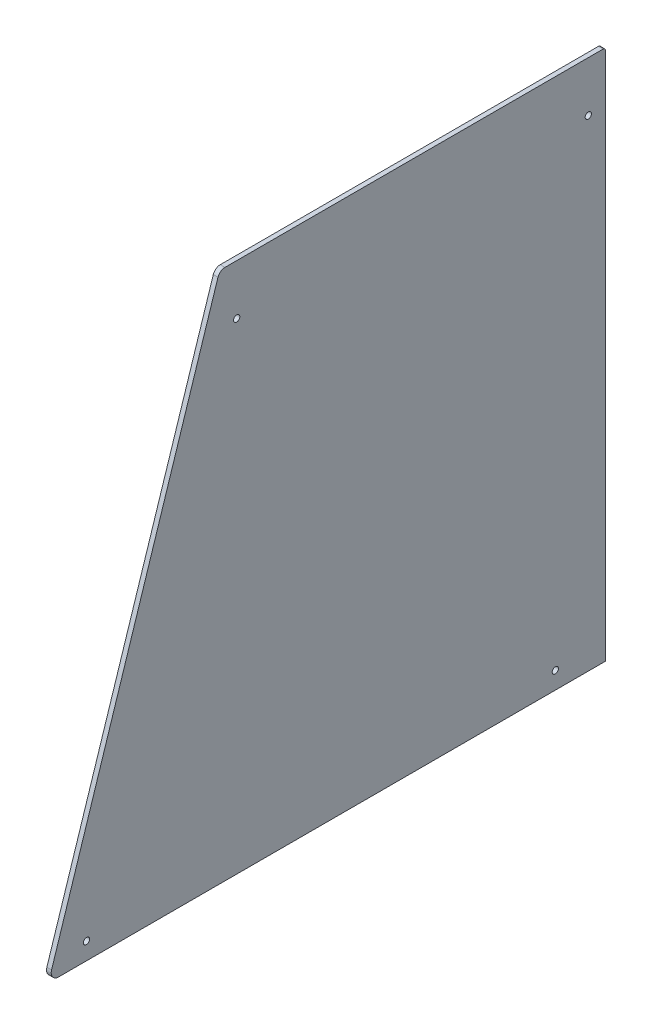
ISO-10303-21;
HEADER;
FILE_DESCRIPTION(('STEP AP214'),'2;1');
FILE_NAME('part.step','',(''),(''),'','','');
FILE_SCHEMA(('AUTOMOTIVE_DESIGN { 1 0 10303 214 1 1 1 1 }'));
ENDSEC;
DATA;
#1=APPLICATION_CONTEXT('core data for automotive mechanical design processes');
#2=APPLICATION_PROTOCOL_DEFINITION('international standard','automotive_design',2000,#1);
#3=PRODUCT_CONTEXT('',#1,'mechanical');
#4=PRODUCT('Part','Part','',(#3));
#5=PRODUCT_RELATED_PRODUCT_CATEGORY('part','',(#4));
#6=PRODUCT_DEFINITION_FORMATION('','',#4);
#7=PRODUCT_DEFINITION_CONTEXT('part definition',#1,'design');
#8=PRODUCT_DEFINITION('design','',#6,#7);
#9=PRODUCT_DEFINITION_SHAPE('','',#8);
#10=(LENGTH_UNIT() NAMED_UNIT(*) SI_UNIT(.MILLI.,.METRE.));
#11=(NAMED_UNIT(*) PLANE_ANGLE_UNIT() SI_UNIT($,.RADIAN.));
#12=(NAMED_UNIT(*) SI_UNIT($,.STERADIAN.) SOLID_ANGLE_UNIT());
#13=UNCERTAINTY_MEASURE_WITH_UNIT(LENGTH_MEASURE(1.E-05),#10,'distance_accuracy_value','');
#14=(GEOMETRIC_REPRESENTATION_CONTEXT(3) GLOBAL_UNCERTAINTY_ASSIGNED_CONTEXT((#13)) GLOBAL_UNIT_ASSIGNED_CONTEXT((#10,
#11,#12)) REPRESENTATION_CONTEXT('',''));
#15=CARTESIAN_POINT('',(0.,0.,0.));
#16=DIRECTION('',(0.,0.,1.));
#17=DIRECTION('',(1.,0.,0.));
#18=AXIS2_PLACEMENT_3D('',#15,#16,#17);
#19=CARTESIAN_POINT('',(107.5,328.5,-121.));
#20=DIRECTION('',(1.,0.,0.));
#21=DIRECTION('',(0.,0.,-1.));
#22=AXIS2_PLACEMENT_3D('',#19,#20,#21);
#23=CYLINDRICAL_SURFACE('',#22,1.50000000000002);
#24=CARTESIAN_POINT('',(110.5,328.5,-121.));
#25=DIRECTION('',(1.,0.,0.));
#26=DIRECTION('',(0.,0.,1.));
#27=AXIS2_PLACEMENT_3D('',#24,#25,#26);
#28=CIRCLE('',#27,1.50000000000002);
#29=CARTESIAN_POINT('',(110.5,328.5,-122.5));
#30=VERTEX_POINT('',#29);
#31=CARTESIAN_POINT('',(110.5,330.,-121.));
#32=VERTEX_POINT('',#31);
#33=EDGE_CURVE('E145',#30,#32,#28,.T.);
#34=ORIENTED_EDGE('',*,*,#33,.F.);
#35=DIRECTION('',(1.,0.,0.));
#36=VECTOR('',#35,1.);
#37=CARTESIAN_POINT('',(107.5,328.5,-122.5));
#38=LINE('',#37,#36);
#39=CARTESIAN_POINT('',(107.5,328.5,-122.5));
#40=VERTEX_POINT('',#39);
#41=EDGE_CURVE('E12',#40,#30,#38,.T.);
#42=ORIENTED_EDGE('',*,*,#41,.F.);
#43=CARTESIAN_POINT('',(107.5,328.5,-121.));
#44=DIRECTION('',(1.,0.,0.));
#45=DIRECTION('',(0.,0.,1.));
#46=AXIS2_PLACEMENT_3D('',#43,#44,#45);
#47=CIRCLE('',#46,1.50000000000002);
#48=CARTESIAN_POINT('',(107.5,330.,-121.));
#49=VERTEX_POINT('',#48);
#50=EDGE_CURVE('E178',#40,#49,#47,.T.);
#51=ORIENTED_EDGE('',*,*,#50,.T.);
#52=DIRECTION('',(1.,0.,0.));
#53=VECTOR('',#52,1.);
#54=CARTESIAN_POINT('',(107.5,330.,-121.));
#55=LINE('',#54,#53);
#56=EDGE_CURVE('E48',#49,#32,#55,.T.);
#57=ORIENTED_EDGE('',*,*,#56,.T.);
#58=EDGE_LOOP('',(#34,#42,#51,#57));
#59=FACE_BOUND('',#58,.T.);
#60=ADVANCED_FACE('F45',(#59),#23,.T.);
#61=CARTESIAN_POINT('',(107.5,328.5,-122.5));
#62=DIRECTION('',(0.,0.,-1.));
#63=DIRECTION('',(0.,1.,0.));
#64=AXIS2_PLACEMENT_3D('',#61,#62,#63);
#65=PLANE('',#64);
#66=DIRECTION('',(0.,1.,0.));
#67=VECTOR('',#66,1.);
#68=CARTESIAN_POINT('',(110.5,328.5,-122.5));
#69=LINE('',#68,#67);
#70=CARTESIAN_POINT('',(110.5,-10.,-122.5));
#71=VERTEX_POINT('',#70);
#72=EDGE_CURVE('E175',#71,#30,#69,.T.);
#73=ORIENTED_EDGE('',*,*,#72,.F.);
#74=DIRECTION('',(1.,0.,0.));
#75=VECTOR('',#74,1.);
#76=CARTESIAN_POINT('',(107.5,-10.,-122.5));
#77=LINE('',#76,#75);
#78=CARTESIAN_POINT('',(107.5,-10.,-122.5));
#79=VERTEX_POINT('',#78);
#80=EDGE_CURVE('E54',#79,#71,#77,.T.);
#81=ORIENTED_EDGE('',*,*,#80,.F.);
#82=DIRECTION('',(0.,1.,0.));
#83=VECTOR('',#82,1.);
#84=CARTESIAN_POINT('',(107.5,328.5,-122.5));
#85=LINE('',#84,#83);
#86=EDGE_CURVE('E131',#79,#40,#85,.T.);
#87=ORIENTED_EDGE('',*,*,#86,.T.);
#88=ORIENTED_EDGE('',*,*,#41,.T.);
#89=EDGE_LOOP('',(#73,#81,#87,#88));
#90=FACE_BOUND('',#89,.T.);
#91=ADVANCED_FACE('F190',(#90),#65,.T.);
#92=CARTESIAN_POINT('',(107.5,-10.,-122.5));
#93=DIRECTION('',(0.,-1.,0.));
#94=DIRECTION('',(0.,0.,-1.));
#95=AXIS2_PLACEMENT_3D('',#92,#93,#94);
#96=PLANE('',#95);
#97=DIRECTION('',(0.,0.,-1.));
#98=VECTOR('',#97,1.);
#99=CARTESIAN_POINT('',(110.5,-10.,-122.5));
#100=LINE('',#99,#98);
#101=CARTESIAN_POINT('',(110.5,-9.99999999999999,227.5));
#102=VERTEX_POINT('',#101);
#103=EDGE_CURVE('E117',#102,#71,#100,.T.);
#104=ORIENTED_EDGE('',*,*,#103,.F.);
#105=DIRECTION('',(1.,0.,0.));
#106=VECTOR('',#105,1.);
#107=CARTESIAN_POINT('',(107.5,-9.99999999999999,227.5));
#108=LINE('',#107,#106);
#109=CARTESIAN_POINT('',(107.5,-9.99999999999999,227.5));
#110=VERTEX_POINT('',#109);
#111=EDGE_CURVE('E112',#110,#102,#108,.T.);
#112=ORIENTED_EDGE('',*,*,#111,.F.);
#113=DIRECTION('',(0.,0.,-1.));
#114=VECTOR('',#113,1.);
#115=CARTESIAN_POINT('',(107.5,-10.,-122.5));
#116=LINE('',#115,#114);
#117=EDGE_CURVE('E115',#110,#79,#116,.T.);
#118=ORIENTED_EDGE('',*,*,#117,.T.);
#119=ORIENTED_EDGE('',*,*,#80,.T.);
#120=EDGE_LOOP('',(#104,#112,#118,#119));
#121=FACE_BOUND('',#120,.T.);
#122=ADVANCED_FACE('F114',(#121),#96,.T.);
#123=CARTESIAN_POINT('',(107.5,-5.30679634622494,227.5));
#124=DIRECTION('',(1.,0.,0.));
#125=DIRECTION('',(0.,0.,-1.));
#126=AXIS2_PLACEMENT_3D('',#123,#124,#125);
#127=CYLINDRICAL_SURFACE('',#126,4.69320365377507);
#128=CARTESIAN_POINT('',(110.5,-5.30679634622494,227.5));
#129=DIRECTION('',(1.,0.,0.));
#130=DIRECTION('',(0.,0.,1.));
#131=AXIS2_PLACEMENT_3D('',#128,#129,#130);
#132=CIRCLE('',#131,4.69320365377507);
#133=CARTESIAN_POINT('',(110.5,-3.86781721319163,231.967157887349));
#134=VERTEX_POINT('',#133);
#135=EDGE_CURVE('E169',#134,#102,#132,.T.);
#136=ORIENTED_EDGE('',*,*,#135,.F.);
#137=DIRECTION('',(1.,0.,0.));
#138=VECTOR('',#137,1.);
#139=CARTESIAN_POINT('',(107.5,-3.86781721319163,231.967157887349));
#140=LINE('',#139,#138);
#141=CARTESIAN_POINT('',(107.5,-3.86781721319163,231.967157887349));
#142=VERTEX_POINT('',#141);
#143=EDGE_CURVE('E123',#142,#134,#140,.T.);
#144=ORIENTED_EDGE('',*,*,#143,.F.);
#145=CARTESIAN_POINT('',(107.5,-5.30679634622494,227.5));
#146=DIRECTION('',(1.,0.,0.));
#147=DIRECTION('',(0.,0.,1.));
#148=AXIS2_PLACEMENT_3D('',#145,#146,#147);
#149=CIRCLE('',#148,4.69320365377507);
#150=EDGE_CURVE('E129',#142,#110,#149,.T.);
#151=ORIENTED_EDGE('',*,*,#150,.T.);
#152=ORIENTED_EDGE('',*,*,#111,.T.);
#153=EDGE_LOOP('',(#136,#144,#151,#152));
#154=FACE_BOUND('',#153,.T.);
#155=ADVANCED_FACE('F134',(#154),#127,.T.);
#156=CARTESIAN_POINT('',(107.5,-3.86781721319163,231.967157887349));
#157=DIRECTION('',(0.,0.30660913934042,0.951835508726653));
#158=DIRECTION('',(0.,-0.951835508726653,0.30660913934042));
#159=AXIS2_PLACEMENT_3D('',#156,#157,#158);
#160=PLANE('',#159);
#161=DIRECTION('',(0.,-0.951835508726653,0.30660913934042));
#162=VECTOR('',#161,1.);
#163=CARTESIAN_POINT('',(110.5,-3.86781721319163,231.967157887349));
#164=LINE('',#163,#162);
#165=CARTESIAN_POINT('',(110.5,326.745775479258,125.468557887349));
#166=VERTEX_POINT('',#165);
#167=EDGE_CURVE('E165',#166,#134,#164,.T.);
#168=ORIENTED_EDGE('',*,*,#167,.F.);
#169=DIRECTION('',(1.,0.,0.));
#170=VECTOR('',#169,1.);
#171=CARTESIAN_POINT('',(107.5,326.745775479258,125.468557887349));
#172=LINE('',#171,#170);
#173=CARTESIAN_POINT('',(107.5,326.745775479258,125.468557887349));
#174=VERTEX_POINT('',#173);
#175=EDGE_CURVE('E183',#174,#166,#172,.T.);
#176=ORIENTED_EDGE('',*,*,#175,.F.);
#177=DIRECTION('',(0.,-0.951835508726653,0.30660913934042));
#178=VECTOR('',#177,1.);
#179=CARTESIAN_POINT('',(107.5,-3.86781721319163,231.967157887349));
#180=LINE('',#179,#178);
#181=EDGE_CURVE('E136',#174,#142,#180,.T.);
#182=ORIENTED_EDGE('',*,*,#181,.T.);
#183=ORIENTED_EDGE('',*,*,#143,.T.);
#184=EDGE_LOOP('',(#168,#176,#182,#183));
#185=FACE_BOUND('',#184,.T.);
#186=ADVANCED_FACE('F203',(#185),#160,.T.);
#187=CARTESIAN_POINT('',(107.5,325.306796346225,121.0014));
#188=DIRECTION('',(1.,0.,0.));
#189=DIRECTION('',(0.,0.,-1.));
#190=AXIS2_PLACEMENT_3D('',#187,#188,#189);
#191=CYLINDRICAL_SURFACE('',#190,4.69320365377511);
#192=CARTESIAN_POINT('',(110.5,325.306796346225,121.0014));
#193=DIRECTION('',(1.,0.,0.));
#194=DIRECTION('',(0.,0.,1.));
#195=AXIS2_PLACEMENT_3D('',#192,#193,#194);
#196=CIRCLE('',#195,4.69320365377511);
#197=CARTESIAN_POINT('',(110.5,330.,121.0014));
#198=VERTEX_POINT('',#197);
#199=EDGE_CURVE('E162',#198,#166,#196,.T.);
#200=ORIENTED_EDGE('',*,*,#199,.F.);
#201=DIRECTION('',(1.,0.,0.));
#202=VECTOR('',#201,1.);
#203=CARTESIAN_POINT('',(107.5,330.,121.0014));
#204=LINE('',#203,#202);
#205=CARTESIAN_POINT('',(107.5,330.,121.0014));
#206=VERTEX_POINT('',#205);
#207=EDGE_CURVE('E184',#206,#198,#204,.T.);
#208=ORIENTED_EDGE('',*,*,#207,.F.);
#209=CARTESIAN_POINT('',(107.5,325.306796346225,121.0014));
#210=DIRECTION('',(1.,0.,0.));
#211=DIRECTION('',(0.,0.,1.));
#212=AXIS2_PLACEMENT_3D('',#209,#210,#211);
#213=CIRCLE('',#212,4.69320365377511);
#214=EDGE_CURVE('E140',#206,#174,#213,.T.);
#215=ORIENTED_EDGE('',*,*,#214,.T.);
#216=ORIENTED_EDGE('',*,*,#175,.T.);
#217=EDGE_LOOP('',(#200,#208,#215,#216));
#218=FACE_BOUND('',#217,.T.);
#219=ADVANCED_FACE('F206',(#218),#191,.T.);
#220=CARTESIAN_POINT('',(107.5,330.,121.0014));
#221=DIRECTION('',(0.,1.,0.));
#222=DIRECTION('',(0.,0.,1.));
#223=AXIS2_PLACEMENT_3D('',#220,#221,#222);
#224=PLANE('',#223);
#225=DIRECTION('',(0.,0.,1.));
#226=VECTOR('',#225,1.);
#227=CARTESIAN_POINT('',(110.5,330.,121.0014));
#228=LINE('',#227,#226);
#229=EDGE_CURVE('E149',#32,#198,#228,.T.);
#230=ORIENTED_EDGE('',*,*,#229,.F.);
#231=ORIENTED_EDGE('',*,*,#56,.F.);
#232=DIRECTION('',(0.,0.,1.));
#233=VECTOR('',#232,1.);
#234=CARTESIAN_POINT('',(107.5,330.,121.0014));
#235=LINE('',#234,#233);
#236=EDGE_CURVE('E273',#49,#206,#235,.T.);
#237=ORIENTED_EDGE('',*,*,#236,.T.);
#238=ORIENTED_EDGE('',*,*,#207,.T.);
#239=EDGE_LOOP('',(#230,#231,#237,#238));
#240=FACE_BOUND('',#239,.T.);
#241=ADVANCED_FACE('F187',(#240),#224,.T.);
#242=CARTESIAN_POINT('',(107.5,328.5,-121.));
#243=DIRECTION('',(-1.,0.,0.));
#244=DIRECTION('',(0.,0.,1.));
#245=AXIS2_PLACEMENT_3D('',#242,#243,#244);
#246=PLANE('',#245);
#247=CARTESIAN_POINT('',(107.5,297.910969137246,-111.5014));
#248=DIRECTION('',(-1.,0.,0.));
#249=DIRECTION('',(0.,0.,1.));
#250=AXIS2_PLACEMENT_3D('',#247,#248,#249);
#251=CIRCLE('',#250,2.);
#252=CARTESIAN_POINT('',(107.5,297.910969137246,-109.5014));
#253=VERTEX_POINT('',#252);
#254=EDGE_CURVE('E241',#253,#253,#251,.F.);
#255=ORIENTED_EDGE('',*,*,#254,.T.);
#256=EDGE_LOOP('',(#255));
#257=FACE_BOUND('',#256,.T.);
#258=CARTESIAN_POINT('',(107.5,0.998599999998107,-90.4109691372463));
#259=DIRECTION('',(-1.,0.,0.));
#260=DIRECTION('',(0.,0.,1.));
#261=AXIS2_PLACEMENT_3D('',#258,#259,#260);
#262=CIRCLE('',#261,2.);
#263=CARTESIAN_POINT('',(107.5,0.998599999998107,-88.4109691372463));
#264=VERTEX_POINT('',#263);
#265=EDGE_CURVE('E255',#264,#264,#262,.F.);
#266=ORIENTED_EDGE('',*,*,#265,.T.);
#267=EDGE_LOOP('',(#266));
#268=FACE_BOUND('',#267,.T.);
#269=CARTESIAN_POINT('',(107.5,0.998599999998107,209.589030862754));
#270=DIRECTION('',(-1.,0.,0.));
#271=DIRECTION('',(0.,0.,1.));
#272=AXIS2_PLACEMENT_3D('',#269,#270,#271);
#273=CIRCLE('',#272,2.);
#274=CARTESIAN_POINT('',(107.5,0.998599999998107,211.589030862754));
#275=VERTEX_POINT('',#274);
#276=EDGE_CURVE('E262',#275,#275,#273,.F.);
#277=ORIENTED_EDGE('',*,*,#276,.T.);
#278=EDGE_LOOP('',(#277));
#279=FACE_BOUND('',#278,.T.);
#280=CARTESIAN_POINT('',(107.5,297.910969137246,113.4986));
#281=DIRECTION('',(-1.,0.,0.));
#282=DIRECTION('',(0.,0.,1.));
#283=AXIS2_PLACEMENT_3D('',#280,#281,#282);
#284=CIRCLE('',#283,2.);
#285=CARTESIAN_POINT('',(107.5,297.910969137246,115.4986));
#286=VERTEX_POINT('',#285);
#287=EDGE_CURVE('E269',#286,#286,#284,.F.);
#288=ORIENTED_EDGE('',*,*,#287,.T.);
#289=EDGE_LOOP('',(#288));
#290=FACE_BOUND('',#289,.T.);
#291=ORIENTED_EDGE('',*,*,#50,.F.);
#292=ORIENTED_EDGE('',*,*,#86,.F.);
#293=ORIENTED_EDGE('',*,*,#117,.F.);
#294=ORIENTED_EDGE('',*,*,#150,.F.);
#295=ORIENTED_EDGE('',*,*,#181,.F.);
#296=ORIENTED_EDGE('',*,*,#214,.F.);
#297=ORIENTED_EDGE('',*,*,#236,.F.);
#298=EDGE_LOOP('',(#291,#292,#293,#294,#295,#296,#297));
#299=FACE_BOUND('',#298,.T.);
#300=ADVANCED_FACE('F127',(#257,#268,#279,#290,#299),#246,.T.);
#301=CARTESIAN_POINT('',(110.5,328.5,-121.));
#302=DIRECTION('',(-1.,0.,0.));
#303=DIRECTION('',(0.,0.,1.));
#304=AXIS2_PLACEMENT_3D('',#301,#302,#303);
#305=PLANE('',#304);
#306=CARTESIAN_POINT('',(110.5,297.910969137246,-111.5014));
#307=DIRECTION('',(1.,0.,0.));
#308=DIRECTION('',(0.,0.,-1.));
#309=AXIS2_PLACEMENT_3D('',#306,#307,#308);
#310=CIRCLE('',#309,2.);
#311=CARTESIAN_POINT('',(110.5,297.910969137246,-113.5014));
#312=VERTEX_POINT('',#311);
#313=EDGE_CURVE('E150',#312,#312,#310,.T.);
#314=ORIENTED_EDGE('',*,*,#313,.F.);
#315=EDGE_LOOP('',(#314));
#316=FACE_BOUND('',#315,.T.);
#317=CARTESIAN_POINT('',(110.5,0.998599999998107,-90.4109691372463));
#318=DIRECTION('',(1.,0.,0.));
#319=DIRECTION('',(0.,0.,-1.));
#320=AXIS2_PLACEMENT_3D('',#317,#318,#319);
#321=CIRCLE('',#320,2.);
#322=CARTESIAN_POINT('',(110.5,0.998599999998107,-92.4109691372463));
#323=VERTEX_POINT('',#322);
#324=EDGE_CURVE('E245',#323,#323,#321,.T.);
#325=ORIENTED_EDGE('',*,*,#324,.F.);
#326=EDGE_LOOP('',(#325));
#327=FACE_BOUND('',#326,.T.);
#328=CARTESIAN_POINT('',(110.5,0.998599999998107,209.589030862754));
#329=DIRECTION('',(1.,0.,0.));
#330=DIRECTION('',(0.,0.,-1.));
#331=AXIS2_PLACEMENT_3D('',#328,#329,#330);
#332=CIRCLE('',#331,2.);
#333=CARTESIAN_POINT('',(110.5,0.998599999998107,207.589030862754));
#334=VERTEX_POINT('',#333);
#335=EDGE_CURVE('E257',#334,#334,#332,.T.);
#336=ORIENTED_EDGE('',*,*,#335,.F.);
#337=EDGE_LOOP('',(#336));
#338=FACE_BOUND('',#337,.T.);
#339=CARTESIAN_POINT('',(110.5,297.910969137246,113.4986));
#340=DIRECTION('',(1.,0.,0.));
#341=DIRECTION('',(0.,0.,-1.));
#342=AXIS2_PLACEMENT_3D('',#339,#340,#341);
#343=CIRCLE('',#342,2.);
#344=CARTESIAN_POINT('',(110.5,297.910969137246,111.4986));
#345=VERTEX_POINT('',#344);
#346=EDGE_CURVE('E265',#345,#345,#343,.T.);
#347=ORIENTED_EDGE('',*,*,#346,.F.);
#348=EDGE_LOOP('',(#347));
#349=FACE_BOUND('',#348,.T.);
#350=ORIENTED_EDGE('',*,*,#33,.T.);
#351=ORIENTED_EDGE('',*,*,#229,.T.);
#352=ORIENTED_EDGE('',*,*,#199,.T.);
#353=ORIENTED_EDGE('',*,*,#167,.T.);
#354=ORIENTED_EDGE('',*,*,#135,.T.);
#355=ORIENTED_EDGE('',*,*,#103,.T.);
#356=ORIENTED_EDGE('',*,*,#72,.T.);
#357=EDGE_LOOP('',(#350,#351,#352,#353,#354,#355,#356));
#358=FACE_BOUND('',#357,.T.);
#359=ADVANCED_FACE('F189',(#316,#327,#338,#349,#358),#305,.F.);
#360=CARTESIAN_POINT('',(107.499,297.910969137246,113.4986));
#361=DIRECTION('',(1.,0.,0.));
#362=DIRECTION('',(0.,0.,-1.));
#363=AXIS2_PLACEMENT_3D('',#360,#361,#362);
#364=CYLINDRICAL_SURFACE('',#363,2.);
#365=ORIENTED_EDGE('',*,*,#287,.F.);
#366=EDGE_LOOP('',(#365));
#367=FACE_BOUND('',#366,.T.);
#368=ORIENTED_EDGE('',*,*,#346,.T.);
#369=EDGE_LOOP('',(#368));
#370=FACE_BOUND('',#369,.T.);
#371=ADVANCED_FACE('F218',(#367,#370),#364,.F.);
#372=CARTESIAN_POINT('',(107.499,0.998599999998107,209.589030862754));
#373=DIRECTION('',(1.,0.,0.));
#374=DIRECTION('',(0.,0.,-1.));
#375=AXIS2_PLACEMENT_3D('',#372,#373,#374);
#376=CYLINDRICAL_SURFACE('',#375,2.);
#377=ORIENTED_EDGE('',*,*,#276,.F.);
#378=EDGE_LOOP('',(#377));
#379=FACE_BOUND('',#378,.T.);
#380=ORIENTED_EDGE('',*,*,#335,.T.);
#381=EDGE_LOOP('',(#380));
#382=FACE_BOUND('',#381,.T.);
#383=ADVANCED_FACE('F225',(#379,#382),#376,.F.);
#384=CARTESIAN_POINT('',(107.499,0.998599999998107,-90.4109691372463));
#385=DIRECTION('',(1.,0.,0.));
#386=DIRECTION('',(0.,0.,-1.));
#387=AXIS2_PLACEMENT_3D('',#384,#385,#386);
#388=CYLINDRICAL_SURFACE('',#387,2.);
#389=ORIENTED_EDGE('',*,*,#265,.F.);
#390=EDGE_LOOP('',(#389));
#391=FACE_BOUND('',#390,.T.);
#392=ORIENTED_EDGE('',*,*,#324,.T.);
#393=EDGE_LOOP('',(#392));
#394=FACE_BOUND('',#393,.T.);
#395=ADVANCED_FACE('F229',(#391,#394),#388,.F.);
#396=CARTESIAN_POINT('',(107.499,297.910969137246,-111.5014));
#397=DIRECTION('',(1.,0.,0.));
#398=DIRECTION('',(0.,0.,-1.));
#399=AXIS2_PLACEMENT_3D('',#396,#397,#398);
#400=CYLINDRICAL_SURFACE('',#399,2.);
#401=ORIENTED_EDGE('',*,*,#254,.F.);
#402=EDGE_LOOP('',(#401));
#403=FACE_BOUND('',#402,.T.);
#404=ORIENTED_EDGE('',*,*,#313,.T.);
#405=EDGE_LOOP('',(#404));
#406=FACE_BOUND('',#405,.T.);
#407=ADVANCED_FACE('F233',(#403,#406),#400,.F.);
#408=CLOSED_SHELL('',(#60,#91,#122,#155,#186,#219,#241,#300,#359,#371,#383,#395,#407));
#409=MANIFOLD_SOLID_BREP('B2',#408);
#410=ADVANCED_BREP_SHAPE_REPRESENTATION('',(#18,#409),#14);
#411=SHAPE_DEFINITION_REPRESENTATION(#9,#410);
ENDSEC;
END-ISO-10303-21;
